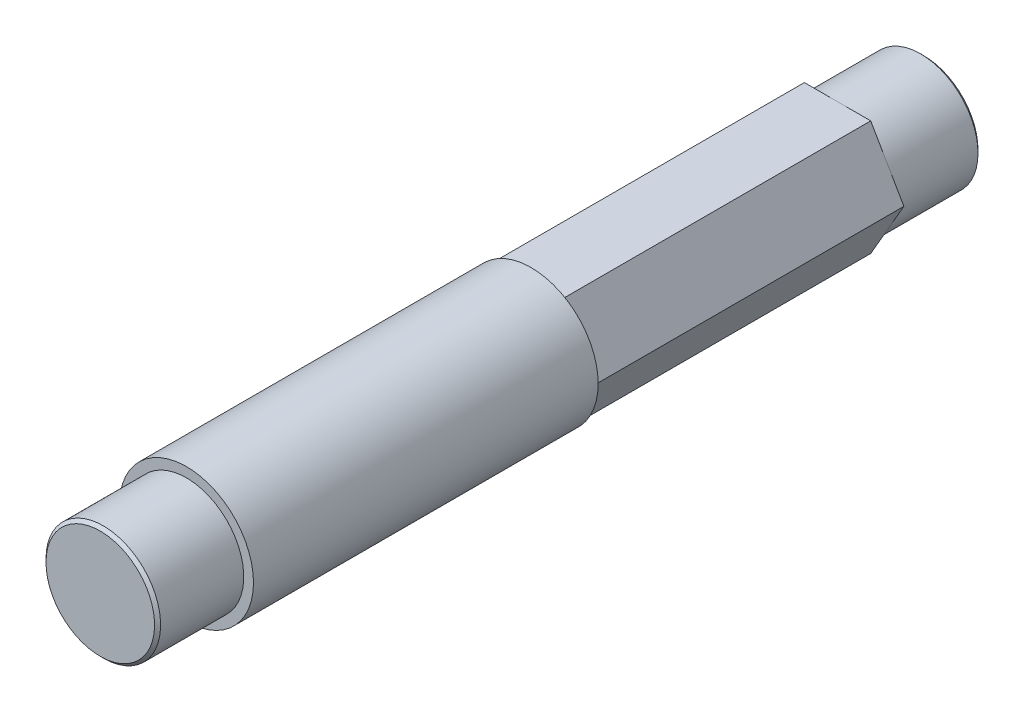
ISO-10303-21;
HEADER;
FILE_DESCRIPTION(('STEP AP214'),'2;1');
FILE_NAME('part.step','',(''),(''),'','','');
FILE_SCHEMA(('AUTOMOTIVE_DESIGN { 1 0 10303 214 1 1 1 1 }'));
ENDSEC;
DATA;
#1=APPLICATION_CONTEXT('core data for automotive mechanical design processes');
#2=APPLICATION_PROTOCOL_DEFINITION('international standard','automotive_design',2000,#1);
#3=PRODUCT_CONTEXT('',#1,'mechanical');
#4=PRODUCT('Part','Part','',(#3));
#5=PRODUCT_RELATED_PRODUCT_CATEGORY('part','',(#4));
#6=PRODUCT_DEFINITION_FORMATION('','',#4);
#7=PRODUCT_DEFINITION_CONTEXT('part definition',#1,'design');
#8=PRODUCT_DEFINITION('design','',#6,#7);
#9=PRODUCT_DEFINITION_SHAPE('','',#8);
#10=(LENGTH_UNIT() NAMED_UNIT(*) SI_UNIT(.MILLI.,.METRE.));
#11=(NAMED_UNIT(*) PLANE_ANGLE_UNIT() SI_UNIT($,.RADIAN.));
#12=(NAMED_UNIT(*) SI_UNIT($,.STERADIAN.) SOLID_ANGLE_UNIT());
#13=UNCERTAINTY_MEASURE_WITH_UNIT(LENGTH_MEASURE(1.E-05),#10,'distance_accuracy_value','');
#14=(GEOMETRIC_REPRESENTATION_CONTEXT(3) GLOBAL_UNCERTAINTY_ASSIGNED_CONTEXT((#13)) GLOBAL_UNIT_ASSIGNED_CONTEXT((#10,
#11,#12)) REPRESENTATION_CONTEXT('',''));
#15=CARTESIAN_POINT('',(0.,0.,0.));
#16=DIRECTION('',(0.,0.,1.));
#17=DIRECTION('',(1.,0.,0.));
#18=AXIS2_PLACEMENT_3D('',#15,#16,#17);
#19=CARTESIAN_POINT('',(0.,0.,-34.13125));
#20=DIRECTION('',(0.,0.,-1.));
#21=DIRECTION('',(-1.,0.,0.));
#22=AXIS2_PLACEMENT_3D('',#19,#20,#21);
#23=PLANE('',#22);
#24=CARTESIAN_POINT('',(0.,0.,-34.1312500000299));
#25=DIRECTION('',(0.,0.,1.));
#26=DIRECTION('',(1.,0.,0.));
#27=AXIS2_PLACEMENT_3D('',#24,#25,#26);
#28=CIRCLE('',#27,4.49979999996231);
#29=CARTESIAN_POINT('',(4.49979999996231,0.,-34.1312500000299));
#30=VERTEX_POINT('',#29);
#31=EDGE_CURVE('E19',#30,#30,#28,.T.);
#32=ORIENTED_EDGE('',*,*,#31,.F.);
#33=EDGE_LOOP('',(#32));
#34=FACE_BOUND('',#33,.T.);
#35=ADVANCED_FACE('F16',(#34),#23,.T.);
#36=CARTESIAN_POINT('',(0.,0.,-33.8812500000358));
#37=DIRECTION('',(0.,0.,1.));
#38=DIRECTION('',(1.,0.,0.));
#39=AXIS2_PLACEMENT_3D('',#36,#37,#38);
#40=CONICAL_SURFACE('',#39,4.74979999995639,0.785398163397448);
#41=CARTESIAN_POINT('',(0.,0.,-33.88125));
#42=DIRECTION('',(0.,0.,1.));
#43=DIRECTION('',(1.,0.,0.));
#44=AXIS2_PLACEMENT_3D('',#41,#42,#43);
#45=CIRCLE('',#44,4.7498);
#46=CARTESIAN_POINT('',(4.7498,0.,-33.88125));
#47=VERTEX_POINT('',#46);
#48=EDGE_CURVE('E101',#47,#47,#45,.T.);
#49=ORIENTED_EDGE('',*,*,#48,.F.);
#50=EDGE_LOOP('',(#49));
#51=FACE_BOUND('',#50,.T.);
#52=ORIENTED_EDGE('',*,*,#31,.T.);
#53=EDGE_LOOP('',(#52));
#54=FACE_BOUND('',#53,.T.);
#55=ADVANCED_FACE('F254',(#51,#54),#40,.T.);
#56=CARTESIAN_POINT('',(0.,0.,-34.13125));
#57=DIRECTION('',(0.,0.,1.));
#58=DIRECTION('',(1.,0.,0.));
#59=AXIS2_PLACEMENT_3D('',#56,#57,#58);
#60=CYLINDRICAL_SURFACE('',#59,4.7498);
#61=CARTESIAN_POINT('',(0.,0.,-26.9875));
#62=DIRECTION('',(0.,0.,1.));
#63=DIRECTION('',(1.,0.,0.));
#64=AXIS2_PLACEMENT_3D('',#61,#62,#63);
#65=CIRCLE('',#64,4.7498);
#66=CARTESIAN_POINT('',(4.7498,0.,-26.9875));
#67=VERTEX_POINT('',#66);
#68=EDGE_CURVE('E103',#67,#67,#65,.F.);
#69=ORIENTED_EDGE('',*,*,#68,.T.);
#70=EDGE_LOOP('',(#69));
#71=FACE_BOUND('',#70,.T.);
#72=ORIENTED_EDGE('',*,*,#48,.T.);
#73=EDGE_LOOP('',(#72));
#74=FACE_BOUND('',#73,.T.);
#75=ADVANCED_FACE('F115',(#71,#74),#60,.T.);
#76=CARTESIAN_POINT('',(0.,0.,34.13125));
#77=DIRECTION('',(0.,0.,1.));
#78=DIRECTION('',(1.,0.,0.));
#79=AXIS2_PLACEMENT_3D('',#76,#77,#78);
#80=PLANE('',#79);
#81=CARTESIAN_POINT('',(0.,0.,34.1312499999162));
#82=DIRECTION('',(0.,0.,-1.));
#83=DIRECTION('',(-1.,0.,0.));
#84=AXIS2_PLACEMENT_3D('',#81,#82,#83);
#85=CIRCLE('',#84,4.49980000001915);
#86=CARTESIAN_POINT('',(-4.49980000001915,0.,34.1312499999162));
#87=VERTEX_POINT('',#86);
#88=EDGE_CURVE('E79',#87,#87,#85,.T.);
#89=ORIENTED_EDGE('',*,*,#88,.F.);
#90=EDGE_LOOP('',(#89));
#91=FACE_BOUND('',#90,.T.);
#92=ADVANCED_FACE('F119',(#91),#80,.T.);
#93=CARTESIAN_POINT('',(0.,0.,-26.9875));
#94=DIRECTION('',(0.,0.,1.));
#95=DIRECTION('',(1.,0.,0.));
#96=AXIS2_PLACEMENT_3D('',#93,#94,#95);
#97=PLANE('',#96);
#98=DIRECTION('',(1.,0.,0.));
#99=VECTOR('',#98,1.);
#100=CARTESIAN_POINT('',(-2.74963065701554,-4.76250000000002,-26.9875));
#101=LINE('',#100,#99);
#102=CARTESIAN_POINT('',(2.74963065701557,-4.76250000000002,-26.9875));
#103=VERTEX_POINT('',#102);
#104=CARTESIAN_POINT('',(-2.74963065701554,-4.76250000000002,-26.9875));
#105=VERTEX_POINT('',#104);
#106=EDGE_CURVE('E296',#103,#105,#101,.F.);
#107=ORIENTED_EDGE('',*,*,#106,.T.);
#108=DIRECTION('',(-0.500000000000001,0.866025403784438,0.));
#109=VECTOR('',#108,1.);
#110=CARTESIAN_POINT('',(-5.49926131403116,0.,-26.9875));
#111=LINE('',#110,#109);
#112=CARTESIAN_POINT('',(-5.49926131403116,0.,-26.9875));
#113=VERTEX_POINT('',#112);
#114=EDGE_CURVE('E75',#105,#113,#111,.T.);
#115=ORIENTED_EDGE('',*,*,#114,.T.);
#116=DIRECTION('',(0.5,0.866025403784439,0.));
#117=VECTOR('',#116,1.);
#118=CARTESIAN_POINT('',(-2.74963065701557,4.7625,-26.9875));
#119=LINE('',#118,#117);
#120=CARTESIAN_POINT('',(-2.74963065701557,4.7625,-26.9875));
#121=VERTEX_POINT('',#120);
#122=EDGE_CURVE('E70',#113,#121,#119,.T.);
#123=ORIENTED_EDGE('',*,*,#122,.T.);
#124=DIRECTION('',(1.,0.,0.));
#125=VECTOR('',#124,1.);
#126=CARTESIAN_POINT('',(2.74963065701559,4.76250000000001,-26.9875));
#127=LINE('',#126,#125);
#128=CARTESIAN_POINT('',(2.74963065701559,4.76250000000001,-26.9875));
#129=VERTEX_POINT('',#128);
#130=EDGE_CURVE('E67',#121,#129,#127,.T.);
#131=ORIENTED_EDGE('',*,*,#130,.T.);
#132=DIRECTION('',(0.5,-0.866025403784438,0.));
#133=VECTOR('',#132,1.);
#134=CARTESIAN_POINT('',(5.49926131403118,0.,-26.9875));
#135=LINE('',#134,#133);
#136=CARTESIAN_POINT('',(5.49926131403118,0.,-26.9875));
#137=VERTEX_POINT('',#136);
#138=EDGE_CURVE('E93',#129,#137,#135,.T.);
#139=ORIENTED_EDGE('',*,*,#138,.T.);
#140=DIRECTION('',(-0.5,-0.866025403784439,0.));
#141=VECTOR('',#140,1.);
#142=CARTESIAN_POINT('',(2.74963065701557,-4.76250000000002,-26.9875));
#143=LINE('',#142,#141);
#144=EDGE_CURVE('E290',#137,#103,#143,.T.);
#145=ORIENTED_EDGE('',*,*,#144,.T.);
#146=EDGE_LOOP('',(#107,#115,#123,#131,#139,#145));
#147=FACE_BOUND('',#146,.T.);
#148=ORIENTED_EDGE('',*,*,#68,.F.);
#149=EDGE_LOOP('',(#148));
#150=FACE_BOUND('',#149,.T.);
#151=ADVANCED_FACE('F72',(#147,#150),#97,.F.);
#152=CARTESIAN_POINT('',(0.,0.,33.8812499998653));
#153=DIRECTION('',(0.,0.,-1.));
#154=DIRECTION('',(-1.,0.,0.));
#155=AXIS2_PLACEMENT_3D('',#152,#153,#154);
#156=CONICAL_SURFACE('',#155,4.74980000007008,0.785398163397448);
#157=CARTESIAN_POINT('',(0.,0.,33.88125));
#158=DIRECTION('',(0.,0.,-1.));
#159=DIRECTION('',(-1.,0.,0.));
#160=AXIS2_PLACEMENT_3D('',#157,#158,#159);
#161=CIRCLE('',#160,4.7498);
#162=CARTESIAN_POINT('',(-4.7498,0.,33.88125));
#163=VERTEX_POINT('',#162);
#164=EDGE_CURVE('E97',#163,#163,#161,.T.);
#165=ORIENTED_EDGE('',*,*,#164,.F.);
#166=EDGE_LOOP('',(#165));
#167=FACE_BOUND('',#166,.T.);
#168=ORIENTED_EDGE('',*,*,#88,.T.);
#169=EDGE_LOOP('',(#168));
#170=FACE_BOUND('',#169,.T.);
#171=ADVANCED_FACE('F118',(#167,#170),#156,.T.);
#172=CARTESIAN_POINT('',(-2.74963065701557,4.7625,26.9875));
#173=DIRECTION('',(0.866025403784439,-0.5,0.));
#174=DIRECTION('',(0.5,0.866025403784439,0.));
#175=AXIS2_PLACEMENT_3D('',#172,#173,#174);
#176=PLANE('',#175);
#177=DIRECTION('',(0.,0.,1.));
#178=VECTOR('',#177,1.);
#179=CARTESIAN_POINT('',(-2.74963065701557,4.7625,26.9875));
#180=LINE('',#179,#178);
#181=CARTESIAN_POINT('',(-2.74963065701557,4.7625,-1.5875));
#182=VERTEX_POINT('',#181);
#183=EDGE_CURVE('E78',#182,#121,#180,.F.);
#184=ORIENTED_EDGE('',*,*,#183,.T.);
#185=ORIENTED_EDGE('',*,*,#122,.F.);
#186=DIRECTION('',(0.,0.,1.));
#187=VECTOR('',#186,1.);
#188=CARTESIAN_POINT('',(-5.49926131403116,0.,26.9875));
#189=LINE('',#188,#187);
#190=CARTESIAN_POINT('',(-5.49926131403116,0.,-1.5875));
#191=VERTEX_POINT('',#190);
#192=EDGE_CURVE('E100',#113,#191,#189,.T.);
#193=ORIENTED_EDGE('',*,*,#192,.T.);
#194=DIRECTION('',(0.5,0.866025403784439,0.));
#195=VECTOR('',#194,1.);
#196=CARTESIAN_POINT('',(-5.49926131403116,0.,-1.5875));
#197=LINE('',#196,#195);
#198=EDGE_CURVE('E84',#191,#182,#197,.T.);
#199=ORIENTED_EDGE('',*,*,#198,.T.);
#200=EDGE_LOOP('',(#184,#185,#193,#199));
#201=FACE_BOUND('',#200,.T.);
#202=ADVANCED_FACE('F82',(#201),#176,.F.);
#203=CARTESIAN_POINT('',(2.74963065701559,4.76250000000001,26.9875));
#204=DIRECTION('',(0.,-1.,0.));
#205=DIRECTION('',(1.,0.,0.));
#206=AXIS2_PLACEMENT_3D('',#203,#204,#205);
#207=PLANE('',#206);
#208=DIRECTION('',(0.,0.,1.));
#209=VECTOR('',#208,1.);
#210=CARTESIAN_POINT('',(2.74963065701559,4.76250000000001,26.9875));
#211=LINE('',#210,#209);
#212=CARTESIAN_POINT('',(2.74963065701559,4.76250000000001,-1.5875));
#213=VERTEX_POINT('',#212);
#214=EDGE_CURVE('E90',#213,#129,#211,.F.);
#215=ORIENTED_EDGE('',*,*,#214,.T.);
#216=ORIENTED_EDGE('',*,*,#130,.F.);
#217=ORIENTED_EDGE('',*,*,#183,.F.);
#218=DIRECTION('',(1.,0.,0.));
#219=VECTOR('',#218,1.);
#220=CARTESIAN_POINT('',(4.4704,4.7625,-1.5875));
#221=LINE('',#220,#219);
#222=EDGE_CURVE('E305',#182,#213,#221,.T.);
#223=ORIENTED_EDGE('',*,*,#222,.T.);
#224=EDGE_LOOP('',(#215,#216,#217,#223));
#225=FACE_BOUND('',#224,.T.);
#226=ADVANCED_FACE('F88',(#225),#207,.F.);
#227=CARTESIAN_POINT('',(5.49926131403118,0.,26.9875));
#228=DIRECTION('',(-0.866025403784438,-0.5,0.));
#229=DIRECTION('',(0.5,-0.866025403784438,0.));
#230=AXIS2_PLACEMENT_3D('',#227,#228,#229);
#231=PLANE('',#230);
#232=DIRECTION('',(0.,0.,1.));
#233=VECTOR('',#232,1.);
#234=CARTESIAN_POINT('',(5.49926131403118,0.,26.9875));
#235=LINE('',#234,#233);
#236=CARTESIAN_POINT('',(5.49926131403118,0.,-1.5875));
#237=VERTEX_POINT('',#236);
#238=EDGE_CURVE('E285',#237,#137,#235,.F.);
#239=ORIENTED_EDGE('',*,*,#238,.T.);
#240=ORIENTED_EDGE('',*,*,#138,.F.);
#241=ORIENTED_EDGE('',*,*,#214,.F.);
#242=DIRECTION('',(0.5,-0.866025403784438,0.));
#243=VECTOR('',#242,1.);
#244=CARTESIAN_POINT('',(2.74963065701559,4.76250000000001,-1.5875));
#245=LINE('',#244,#243);
#246=EDGE_CURVE('E288',#213,#237,#245,.T.);
#247=ORIENTED_EDGE('',*,*,#246,.T.);
#248=EDGE_LOOP('',(#239,#240,#241,#247));
#249=FACE_BOUND('',#248,.T.);
#250=ADVANCED_FACE('F160',(#249),#231,.F.);
#251=CARTESIAN_POINT('',(2.74963065701557,-4.76250000000002,26.9875));
#252=DIRECTION('',(-0.866025403784439,0.5,0.));
#253=DIRECTION('',(-0.5,-0.866025403784439,0.));
#254=AXIS2_PLACEMENT_3D('',#251,#252,#253);
#255=PLANE('',#254);
#256=DIRECTION('',(0.,0.,1.));
#257=VECTOR('',#256,1.);
#258=CARTESIAN_POINT('',(2.74963065701557,-4.76250000000002,26.9875));
#259=LINE('',#258,#257);
#260=CARTESIAN_POINT('',(2.74963065701557,-4.76250000000002,-1.5875));
#261=VERTEX_POINT('',#260);
#262=EDGE_CURVE('E293',#261,#103,#259,.F.);
#263=ORIENTED_EDGE('',*,*,#262,.T.);
#264=ORIENTED_EDGE('',*,*,#144,.F.);
#265=ORIENTED_EDGE('',*,*,#238,.F.);
#266=DIRECTION('',(-0.5,-0.866025403784438,0.));
#267=VECTOR('',#266,1.);
#268=CARTESIAN_POINT('',(5.49926131403118,0.,-1.5875));
#269=LINE('',#268,#267);
#270=EDGE_CURVE('E308',#237,#261,#269,.T.);
#271=ORIENTED_EDGE('',*,*,#270,.T.);
#272=EDGE_LOOP('',(#263,#264,#265,#271));
#273=FACE_BOUND('',#272,.T.);
#274=ADVANCED_FACE('F157',(#273),#255,.F.);
#275=CARTESIAN_POINT('',(-2.74963065701554,-4.76250000000002,26.9875));
#276=DIRECTION('',(0.,1.,0.));
#277=DIRECTION('',(0.,0.,1.));
#278=AXIS2_PLACEMENT_3D('',#275,#276,#277);
#279=PLANE('',#278);
#280=DIRECTION('',(0.,0.,1.));
#281=VECTOR('',#280,1.);
#282=CARTESIAN_POINT('',(-2.74963065701554,-4.76250000000002,26.9875));
#283=LINE('',#282,#281);
#284=CARTESIAN_POINT('',(-2.74963065701554,-4.76250000000002,-1.5875));
#285=VERTEX_POINT('',#284);
#286=EDGE_CURVE('E300',#285,#105,#283,.F.);
#287=ORIENTED_EDGE('',*,*,#286,.T.);
#288=ORIENTED_EDGE('',*,*,#106,.F.);
#289=ORIENTED_EDGE('',*,*,#262,.F.);
#290=DIRECTION('',(1.,0.,0.));
#291=VECTOR('',#290,1.);
#292=CARTESIAN_POINT('',(4.4704,-4.76250000000002,-1.5875));
#293=LINE('',#292,#291);
#294=EDGE_CURVE('E34',#261,#285,#293,.F.);
#295=ORIENTED_EDGE('',*,*,#294,.T.);
#296=EDGE_LOOP('',(#287,#288,#289,#295));
#297=FACE_BOUND('',#296,.T.);
#298=ADVANCED_FACE('F153',(#297),#279,.F.);
#299=CARTESIAN_POINT('',(-5.49926131403116,0.,26.9875));
#300=DIRECTION('',(0.866025403784438,0.500000000000001,0.));
#301=DIRECTION('',(-0.500000000000001,0.866025403784438,0.));
#302=AXIS2_PLACEMENT_3D('',#299,#300,#301);
#303=PLANE('',#302);
#304=ORIENTED_EDGE('',*,*,#192,.F.);
#305=ORIENTED_EDGE('',*,*,#114,.F.);
#306=ORIENTED_EDGE('',*,*,#286,.F.);
#307=DIRECTION('',(-0.500000000000001,0.866025403784438,0.));
#308=VECTOR('',#307,1.);
#309=CARTESIAN_POINT('',(-2.74963065701554,-4.76250000000002,-1.5875));
#310=LINE('',#309,#308);
#311=EDGE_CURVE('E110',#285,#191,#310,.T.);
#312=ORIENTED_EDGE('',*,*,#311,.T.);
#313=EDGE_LOOP('',(#304,#305,#306,#312));
#314=FACE_BOUND('',#313,.T.);
#315=ADVANCED_FACE('F149',(#314),#303,.F.);
#316=CARTESIAN_POINT('',(0.,0.,34.13125));
#317=DIRECTION('',(0.,0.,-1.));
#318=DIRECTION('',(-1.,0.,0.));
#319=AXIS2_PLACEMENT_3D('',#316,#317,#318);
#320=CYLINDRICAL_SURFACE('',#319,4.7498);
#321=CARTESIAN_POINT('',(0.,0.,26.9875));
#322=DIRECTION('',(0.,0.,-1.));
#323=DIRECTION('',(-1.,0.,0.));
#324=AXIS2_PLACEMENT_3D('',#321,#322,#323);
#325=CIRCLE('',#324,4.7498);
#326=CARTESIAN_POINT('',(-4.7498,0.,26.9875));
#327=VERTEX_POINT('',#326);
#328=EDGE_CURVE('E107',#327,#327,#325,.T.);
#329=ORIENTED_EDGE('',*,*,#328,.F.);
#330=EDGE_LOOP('',(#329));
#331=FACE_BOUND('',#330,.T.);
#332=ORIENTED_EDGE('',*,*,#164,.T.);
#333=EDGE_LOOP('',(#332));
#334=FACE_BOUND('',#333,.T.);
#335=ADVANCED_FACE('F145',(#331,#334),#320,.T.);
#336=CARTESIAN_POINT('',(4.4704,0.,-1.5875));
#337=DIRECTION('',(0.,0.,1.));
#338=DIRECTION('',(1.,0.,0.));
#339=AXIS2_PLACEMENT_3D('',#336,#337,#338);
#340=PLANE('',#339);
#341=ORIENTED_EDGE('',*,*,#294,.F.);
#342=ORIENTED_EDGE('',*,*,#270,.F.);
#343=ORIENTED_EDGE('',*,*,#246,.F.);
#344=ORIENTED_EDGE('',*,*,#222,.F.);
#345=ORIENTED_EDGE('',*,*,#198,.F.);
#346=ORIENTED_EDGE('',*,*,#311,.F.);
#347=EDGE_LOOP('',(#341,#342,#343,#344,#345,#346));
#348=FACE_BOUND('',#347,.T.);
#349=CARTESIAN_POINT('',(0.,0.,-1.5875));
#350=DIRECTION('',(0.,0.,1.));
#351=DIRECTION('',(1.,0.,0.));
#352=AXIS2_PLACEMENT_3D('',#349,#350,#351);
#353=CIRCLE('',#352,5.55625);
#354=CARTESIAN_POINT('',(5.55625,0.,-1.5875));
#355=VERTEX_POINT('',#354);
#356=EDGE_CURVE('E25',#355,#355,#353,.T.);
#357=ORIENTED_EDGE('',*,*,#356,.F.);
#358=EDGE_LOOP('',(#357));
#359=FACE_BOUND('',#358,.T.);
#360=ADVANCED_FACE('F138',(#348,#359),#340,.F.);
#361=CARTESIAN_POINT('',(0.,0.,26.9875));
#362=DIRECTION('',(0.,0.,1.));
#363=DIRECTION('',(1.,0.,0.));
#364=AXIS2_PLACEMENT_3D('',#361,#362,#363);
#365=PLANE('',#364);
#366=CARTESIAN_POINT('',(0.,0.,26.9875));
#367=DIRECTION('',(0.,0.,1.));
#368=DIRECTION('',(1.,0.,0.));
#369=AXIS2_PLACEMENT_3D('',#366,#367,#368);
#370=CIRCLE('',#369,5.55625);
#371=CARTESIAN_POINT('',(5.55625,0.,26.9875));
#372=VERTEX_POINT('',#371);
#373=EDGE_CURVE('E11',#372,#372,#370,.F.);
#374=ORIENTED_EDGE('',*,*,#373,.F.);
#375=EDGE_LOOP('',(#374));
#376=FACE_BOUND('',#375,.T.);
#377=ORIENTED_EDGE('',*,*,#328,.T.);
#378=EDGE_LOOP('',(#377));
#379=FACE_BOUND('',#378,.T.);
#380=ADVANCED_FACE('F132',(#376,#379),#365,.T.);
#381=CARTESIAN_POINT('',(0.,0.,-17.302948211871));
#382=DIRECTION('',(0.,0.,1.));
#383=DIRECTION('',(1.,0.,0.));
#384=AXIS2_PLACEMENT_3D('',#381,#382,#383);
#385=CYLINDRICAL_SURFACE('',#384,5.55625);
#386=ORIENTED_EDGE('',*,*,#373,.T.);
#387=EDGE_LOOP('',(#386));
#388=FACE_BOUND('',#387,.T.);
#389=ORIENTED_EDGE('',*,*,#356,.T.);
#390=EDGE_LOOP('',(#389));
#391=FACE_BOUND('',#390,.T.);
#392=ADVANCED_FACE('F130',(#388,#391),#385,.T.);
#393=CLOSED_SHELL('',(#35,#55,#75,#92,#151,#171,#202,#226,#250,#274,#298,#315,#335,#360,#380,#392));
#394=MANIFOLD_SOLID_BREP('B1',#393);
#395=ADVANCED_BREP_SHAPE_REPRESENTATION('',(#18,#394),#14);
#396=SHAPE_DEFINITION_REPRESENTATION(#9,#395);
ENDSEC;
END-ISO-10303-21;
